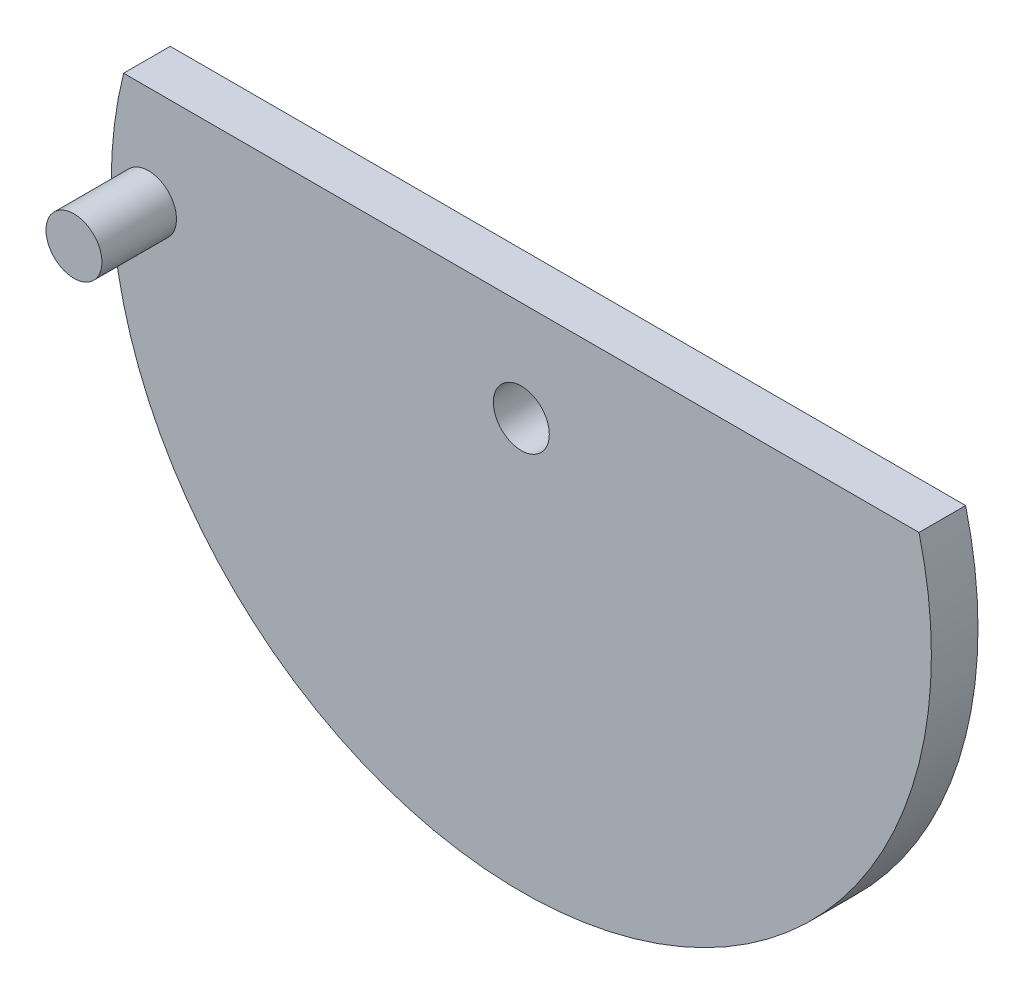
ISO-10303-21;
HEADER;
FILE_DESCRIPTION(('STEP AP214'),'2;1');
FILE_NAME('part.step','',(''),(''),'','','');
FILE_SCHEMA(('AUTOMOTIVE_DESIGN { 1 0 10303 214 1 1 1 1 }'));
ENDSEC;
DATA;
#1=APPLICATION_CONTEXT('core data for automotive mechanical design processes');
#2=APPLICATION_PROTOCOL_DEFINITION('international standard','automotive_design',2000,#1);
#3=PRODUCT_CONTEXT('',#1,'mechanical');
#4=PRODUCT('Part','Part','',(#3));
#5=PRODUCT_RELATED_PRODUCT_CATEGORY('part','',(#4));
#6=PRODUCT_DEFINITION_FORMATION('','',#4);
#7=PRODUCT_DEFINITION_CONTEXT('part definition',#1,'design');
#8=PRODUCT_DEFINITION('design','',#6,#7);
#9=PRODUCT_DEFINITION_SHAPE('','',#8);
#10=(LENGTH_UNIT() NAMED_UNIT(*) SI_UNIT(.MILLI.,.METRE.));
#11=(NAMED_UNIT(*) PLANE_ANGLE_UNIT() SI_UNIT($,.RADIAN.));
#12=(NAMED_UNIT(*) SI_UNIT($,.STERADIAN.) SOLID_ANGLE_UNIT());
#13=UNCERTAINTY_MEASURE_WITH_UNIT(LENGTH_MEASURE(1.E-05),#10,'distance_accuracy_value','');
#14=(GEOMETRIC_REPRESENTATION_CONTEXT(3) GLOBAL_UNCERTAINTY_ASSIGNED_CONTEXT((#13)) GLOBAL_UNIT_ASSIGNED_CONTEXT((#10,
#11,#12)) REPRESENTATION_CONTEXT('',''));
#15=CARTESIAN_POINT('',(0.,0.,0.));
#16=DIRECTION('',(0.,0.,1.));
#17=DIRECTION('',(1.,0.,0.));
#18=AXIS2_PLACEMENT_3D('',#15,#16,#17);
#19=CARTESIAN_POINT('',(0.,8.31772379143406,2.5));
#20=DIRECTION('',(0.,0.,-1.));
#21=DIRECTION('',(-1.,0.,0.));
#22=AXIS2_PLACEMENT_3D('',#19,#20,#21);
#23=PLANE('',#22);
#24=CARTESIAN_POINT('',(-20.,8.31772379143406,2.5));
#25=DIRECTION('',(0.,0.,-1.));
#26=DIRECTION('',(-1.,0.,0.));
#27=AXIS2_PLACEMENT_3D('',#24,#25,#26);
#28=CIRCLE('',#27,1.5);
#29=CARTESIAN_POINT('',(-21.5,8.31772379143406,2.5));
#30=VERTEX_POINT('',#29);
#31=EDGE_CURVE('E11',#30,#30,#28,.F.);
#32=ORIENTED_EDGE('',*,*,#31,.F.);
#33=EDGE_LOOP('',(#32));
#34=FACE_BOUND('',#33,.T.);
#35=CARTESIAN_POINT('',(0.,8.31772379143406,2.5));
#36=DIRECTION('',(0.,0.,1.));
#37=DIRECTION('',(-1.,0.,0.));
#38=AXIS2_PLACEMENT_3D('',#35,#36,#37);
#39=CIRCLE('',#38,22.);
#40=CARTESIAN_POINT('',(-21.3359222290447,13.6822762085659,2.5));
#41=VERTEX_POINT('',#40);
#42=CARTESIAN_POINT('',(21.3359222290447,13.6822762085659,2.5));
#43=VERTEX_POINT('',#42);
#44=EDGE_CURVE('E70',#41,#43,#39,.T.);
#45=ORIENTED_EDGE('',*,*,#44,.T.);
#46=DIRECTION('',(-1.,0.,0.));
#47=VECTOR('',#46,1.);
#48=CARTESIAN_POINT('',(-21.3359222290447,13.6822762085659,2.5));
#49=LINE('',#48,#47);
#50=EDGE_CURVE('E53',#43,#41,#49,.T.);
#51=ORIENTED_EDGE('',*,*,#50,.T.);
#52=EDGE_LOOP('',(#45,#51));
#53=FACE_BOUND('',#52,.T.);
#54=CARTESIAN_POINT('',(0.,8.31772379143406,2.5));
#55=DIRECTION('',(0.,0.,1.));
#56=DIRECTION('',(1.,0.,0.));
#57=AXIS2_PLACEMENT_3D('',#54,#55,#56);
#58=CIRCLE('',#57,1.5);
#59=CARTESIAN_POINT('',(1.5,8.31772379143406,2.5));
#60=VERTEX_POINT('',#59);
#61=EDGE_CURVE('E77',#60,#60,#58,.T.);
#62=ORIENTED_EDGE('',*,*,#61,.F.);
#63=EDGE_LOOP('',(#62));
#64=FACE_BOUND('',#63,.T.);
#65=ADVANCED_FACE('F37',(#34,#53,#64),#23,.F.);
#66=CARTESIAN_POINT('',(0.,8.31772379143406,0.));
#67=DIRECTION('',(0.,0.,-1.));
#68=DIRECTION('',(-1.,0.,0.));
#69=AXIS2_PLACEMENT_3D('',#66,#67,#68);
#70=PLANE('',#69);
#71=CARTESIAN_POINT('',(0.,8.31772379143406,0.));
#72=DIRECTION('',(0.,0.,1.));
#73=DIRECTION('',(-1.,0.,0.));
#74=AXIS2_PLACEMENT_3D('',#71,#72,#73);
#75=CIRCLE('',#74,22.);
#76=CARTESIAN_POINT('',(-21.3359222290447,13.6822762085659,0.));
#77=VERTEX_POINT('',#76);
#78=CARTESIAN_POINT('',(21.3359222290447,13.6822762085659,0.));
#79=VERTEX_POINT('',#78);
#80=EDGE_CURVE('E71',#77,#79,#75,.T.);
#81=ORIENTED_EDGE('',*,*,#80,.F.);
#82=DIRECTION('',(-1.,0.,0.));
#83=VECTOR('',#82,1.);
#84=CARTESIAN_POINT('',(-21.3359222290447,13.6822762085659,0.));
#85=LINE('',#84,#83);
#86=EDGE_CURVE('E61',#79,#77,#85,.T.);
#87=ORIENTED_EDGE('',*,*,#86,.F.);
#88=EDGE_LOOP('',(#81,#87));
#89=FACE_BOUND('',#88,.T.);
#90=CARTESIAN_POINT('',(0.,8.31772379143406,0.));
#91=DIRECTION('',(0.,0.,1.));
#92=DIRECTION('',(1.,0.,0.));
#93=AXIS2_PLACEMENT_3D('',#90,#91,#92);
#94=CIRCLE('',#93,1.5);
#95=CARTESIAN_POINT('',(1.5,8.31772379143406,0.));
#96=VERTEX_POINT('',#95);
#97=EDGE_CURVE('E80',#96,#96,#94,.T.);
#98=ORIENTED_EDGE('',*,*,#97,.T.);
#99=EDGE_LOOP('',(#98));
#100=FACE_BOUND('',#99,.T.);
#101=ADVANCED_FACE('F75',(#89,#100),#70,.T.);
#102=CARTESIAN_POINT('',(0.,8.31772379143406,2.5));
#103=DIRECTION('',(0.,0.,-1.));
#104=DIRECTION('',(-1.,0.,0.));
#105=AXIS2_PLACEMENT_3D('',#102,#103,#104);
#106=CYLINDRICAL_SURFACE('',#105,22.);
#107=ORIENTED_EDGE('',*,*,#80,.T.);
#108=DIRECTION('',(0.,0.,-1.));
#109=VECTOR('',#108,1.);
#110=CARTESIAN_POINT('',(21.3359222290447,13.6822762085659,2.5));
#111=LINE('',#110,#109);
#112=EDGE_CURVE('E46',#43,#79,#111,.T.);
#113=ORIENTED_EDGE('',*,*,#112,.F.);
#114=ORIENTED_EDGE('',*,*,#44,.F.);
#115=DIRECTION('',(0.,0.,-1.));
#116=VECTOR('',#115,1.);
#117=CARTESIAN_POINT('',(-21.3359222290447,13.6822762085659,2.5));
#118=LINE('',#117,#116);
#119=EDGE_CURVE('E66',#41,#77,#118,.T.);
#120=ORIENTED_EDGE('',*,*,#119,.T.);
#121=EDGE_LOOP('',(#107,#113,#114,#120));
#122=FACE_BOUND('',#121,.T.);
#123=ADVANCED_FACE('F39',(#122),#106,.T.);
#124=CARTESIAN_POINT('',(-21.3359222290447,13.6822762085659,2.5));
#125=DIRECTION('',(0.,-1.,0.));
#126=DIRECTION('',(0.,0.,-1.));
#127=AXIS2_PLACEMENT_3D('',#124,#125,#126);
#128=PLANE('',#127);
#129=ORIENTED_EDGE('',*,*,#86,.T.);
#130=ORIENTED_EDGE('',*,*,#119,.F.);
#131=ORIENTED_EDGE('',*,*,#50,.F.);
#132=ORIENTED_EDGE('',*,*,#112,.T.);
#133=EDGE_LOOP('',(#129,#130,#131,#132));
#134=FACE_BOUND('',#133,.T.);
#135=ADVANCED_FACE('F65',(#134),#128,.F.);
#136=CARTESIAN_POINT('',(0.,8.31772379143406,2.5));
#137=DIRECTION('',(0.,0.,-1.));
#138=DIRECTION('',(-1.,0.,0.));
#139=AXIS2_PLACEMENT_3D('',#136,#137,#138);
#140=CYLINDRICAL_SURFACE('',#139,1.5);
#141=ORIENTED_EDGE('',*,*,#61,.T.);
#142=EDGE_LOOP('',(#141));
#143=FACE_BOUND('',#142,.T.);
#144=ORIENTED_EDGE('',*,*,#97,.F.);
#145=EDGE_LOOP('',(#144));
#146=FACE_BOUND('',#145,.T.);
#147=ADVANCED_FACE('F96',(#143,#146),#140,.F.);
#148=CARTESIAN_POINT('',(-20.,8.31772379143406,6.5));
#149=DIRECTION('',(0.,0.,-1.));
#150=DIRECTION('',(-1.,0.,0.));
#151=AXIS2_PLACEMENT_3D('',#148,#149,#150);
#152=CYLINDRICAL_SURFACE('',#151,1.5);
#153=CARTESIAN_POINT('',(-20.,8.31772379143406,6.5));
#154=DIRECTION('',(0.,0.,1.));
#155=DIRECTION('',(1.,0.,0.));
#156=AXIS2_PLACEMENT_3D('',#153,#154,#155);
#157=CIRCLE('',#156,1.5);
#158=CARTESIAN_POINT('',(-18.5,8.31772379143406,6.5));
#159=VERTEX_POINT('',#158);
#160=EDGE_CURVE('E86',#159,#159,#157,.T.);
#161=ORIENTED_EDGE('',*,*,#160,.F.);
#162=EDGE_LOOP('',(#161));
#163=FACE_BOUND('',#162,.T.);
#164=ORIENTED_EDGE('',*,*,#31,.T.);
#165=EDGE_LOOP('',(#164));
#166=FACE_BOUND('',#165,.T.);
#167=ADVANCED_FACE('F93',(#163,#166),#152,.T.);
#168=CARTESIAN_POINT('',(-20.,8.31772379143406,6.5));
#169=DIRECTION('',(0.,0.,1.));
#170=DIRECTION('',(1.,0.,0.));
#171=AXIS2_PLACEMENT_3D('',#168,#169,#170);
#172=PLANE('',#171);
#173=ORIENTED_EDGE('',*,*,#160,.T.);
#174=EDGE_LOOP('',(#173));
#175=FACE_BOUND('',#174,.T.);
#176=ADVANCED_FACE('F91',(#175),#172,.T.);
#177=CLOSED_SHELL('',(#65,#101,#123,#135,#147,#167,#176));
#178=MANIFOLD_SOLID_BREP('B2',#177);
#179=ADVANCED_BREP_SHAPE_REPRESENTATION('',(#18,#178),#14);
#180=SHAPE_DEFINITION_REPRESENTATION(#9,#179);
ENDSEC;
END-ISO-10303-21;
